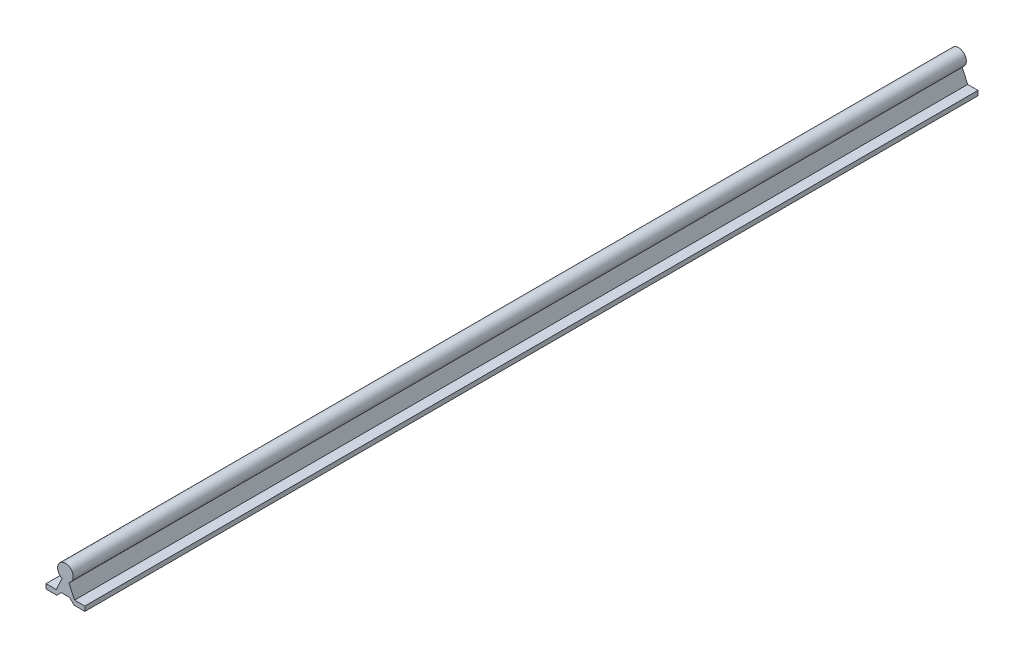
ISO-10303-21;
HEADER;
FILE_DESCRIPTION(('STEP AP214'),'2;1');
FILE_NAME('part.step','',(''),(''),'','','');
FILE_SCHEMA(('AUTOMOTIVE_DESIGN { 1 0 10303 214 1 1 1 1 }'));
ENDSEC;
DATA;
#1=APPLICATION_CONTEXT('core data for automotive mechanical design processes');
#2=APPLICATION_PROTOCOL_DEFINITION('international standard','automotive_design',2000,#1);
#3=PRODUCT_CONTEXT('',#1,'mechanical');
#4=PRODUCT('Part','Part','',(#3));
#5=PRODUCT_RELATED_PRODUCT_CATEGORY('part','',(#4));
#6=PRODUCT_DEFINITION_FORMATION('','',#4);
#7=PRODUCT_DEFINITION_CONTEXT('part definition',#1,'design');
#8=PRODUCT_DEFINITION('design','',#6,#7);
#9=PRODUCT_DEFINITION_SHAPE('','',#8);
#10=(LENGTH_UNIT() NAMED_UNIT(*) SI_UNIT(.MILLI.,.METRE.));
#11=(NAMED_UNIT(*) PLANE_ANGLE_UNIT() SI_UNIT($,.RADIAN.));
#12=(NAMED_UNIT(*) SI_UNIT($,.STERADIAN.) SOLID_ANGLE_UNIT());
#13=UNCERTAINTY_MEASURE_WITH_UNIT(LENGTH_MEASURE(1.E-05),#10,'distance_accuracy_value','');
#14=(GEOMETRIC_REPRESENTATION_CONTEXT(3) GLOBAL_UNCERTAINTY_ASSIGNED_CONTEXT((#13)) GLOBAL_UNIT_ASSIGNED_CONTEXT((#10,
#11,#12)) REPRESENTATION_CONTEXT('',''));
#15=CARTESIAN_POINT('',(0.,0.,0.));
#16=DIRECTION('',(0.,0.,1.));
#17=DIRECTION('',(1.,0.,0.));
#18=AXIS2_PLACEMENT_3D('',#15,#16,#17);
#19=CARTESIAN_POINT('',(9.5641655714519,4.38765921480913,914.4));
#20=DIRECTION('',(0.908917784747808,0.416975371657772,0.));
#21=DIRECTION('',(-0.416975371657772,0.908917784747808,0.));
#22=AXIS2_PLACEMENT_3D('',#19,#20,#21);
#23=PLANE('',#22);
#24=DIRECTION('',(0.416975371657772,-0.908917784747808,0.));
#25=VECTOR('',#24,1.);
#26=CARTESIAN_POINT('',(9.5641655714519,4.38765921480913,0.));
#27=LINE('',#26,#25);
#28=CARTESIAN_POINT('',(3.5,17.6062527150309,0.));
#29=VERTEX_POINT('',#28);
#30=CARTESIAN_POINT('',(9.375,4.79999999999999,0.));
#31=VERTEX_POINT('',#30);
#32=EDGE_CURVE('E155',#29,#31,#27,.T.);
#33=ORIENTED_EDGE('',*,*,#32,.F.);
#34=DIRECTION('',(0.,0.,-1.));
#35=VECTOR('',#34,1.);
#36=CARTESIAN_POINT('',(3.5,17.6062527150309,914.4));
#37=LINE('',#36,#35);
#38=CARTESIAN_POINT('',(3.5,17.6062527150309,914.4));
#39=VERTEX_POINT('',#38);
#40=EDGE_CURVE('E11',#39,#29,#37,.T.);
#41=ORIENTED_EDGE('',*,*,#40,.F.);
#42=DIRECTION('',(0.416975371657772,-0.908917784747808,0.));
#43=VECTOR('',#42,1.);
#44=CARTESIAN_POINT('',(9.5641655714519,4.38765921480913,914.4));
#45=LINE('',#44,#43);
#46=CARTESIAN_POINT('',(9.375,4.79999999999999,914.4));
#47=VERTEX_POINT('',#46);
#48=EDGE_CURVE('E181',#39,#47,#45,.T.);
#49=ORIENTED_EDGE('',*,*,#48,.T.);
#50=DIRECTION('',(0.,0.,-1.));
#51=VECTOR('',#50,1.);
#52=CARTESIAN_POINT('',(9.375,4.79999999999999,914.4));
#53=LINE('',#52,#51);
#54=EDGE_CURVE('E100',#47,#31,#53,.T.);
#55=ORIENTED_EDGE('',*,*,#54,.T.);
#56=EDGE_LOOP('',(#33,#41,#49,#55));
#57=FACE_BOUND('',#56,.T.);
#58=ADVANCED_FACE('F38',(#57),#23,.T.);
#59=CARTESIAN_POINT('',(0.,24.8,914.4));
#60=DIRECTION('',(0.,0.,-1.));
#61=DIRECTION('',(-1.,0.,0.));
#62=AXIS2_PLACEMENT_3D('',#59,#60,#61);
#63=CYLINDRICAL_SURFACE('',#62,8.);
#64=CARTESIAN_POINT('',(0.,24.8,0.));
#65=DIRECTION('',(0.,0.,1.));
#66=DIRECTION('',(1.,0.,0.));
#67=AXIS2_PLACEMENT_3D('',#64,#65,#66);
#68=CIRCLE('',#67,8.);
#69=CARTESIAN_POINT('',(-3.5,17.6062527150309,0.));
#70=VERTEX_POINT('',#69);
#71=EDGE_CURVE('E158',#29,#70,#68,.T.);
#72=ORIENTED_EDGE('',*,*,#71,.T.);
#73=DIRECTION('',(0.,0.,-1.));
#74=VECTOR('',#73,1.);
#75=CARTESIAN_POINT('',(-3.5,17.6062527150309,914.4));
#76=LINE('',#75,#74);
#77=CARTESIAN_POINT('',(-3.5,17.6062527150309,914.4));
#78=VERTEX_POINT('',#77);
#79=EDGE_CURVE('E46',#78,#70,#76,.T.);
#80=ORIENTED_EDGE('',*,*,#79,.F.);
#81=CARTESIAN_POINT('',(0.,24.8,914.4));
#82=DIRECTION('',(0.,0.,1.));
#83=DIRECTION('',(1.,0.,0.));
#84=AXIS2_PLACEMENT_3D('',#81,#82,#83);
#85=CIRCLE('',#84,8.);
#86=EDGE_CURVE('E242',#39,#78,#85,.T.);
#87=ORIENTED_EDGE('',*,*,#86,.F.);
#88=ORIENTED_EDGE('',*,*,#40,.T.);
#89=EDGE_LOOP('',(#72,#80,#87,#88));
#90=FACE_BOUND('',#89,.T.);
#91=ADVANCED_FACE('F245',(#90),#63,.T.);
#92=CARTESIAN_POINT('',(-9.5641655714519,4.38765921480913,914.4));
#93=DIRECTION('',(0.908917784747808,-0.416975371657772,0.));
#94=DIRECTION('',(0.416975371657772,0.908917784747808,0.));
#95=AXIS2_PLACEMENT_3D('',#92,#93,#94);
#96=PLANE('',#95);
#97=DIRECTION('',(-0.416975371657772,-0.908917784747808,0.));
#98=VECTOR('',#97,1.);
#99=CARTESIAN_POINT('',(-9.5641655714519,4.38765921480913,0.));
#100=LINE('',#99,#98);
#101=CARTESIAN_POINT('',(-9.375,4.79999999999999,0.));
#102=VERTEX_POINT('',#101);
#103=EDGE_CURVE('E160',#70,#102,#100,.T.);
#104=ORIENTED_EDGE('',*,*,#103,.T.);
#105=DIRECTION('',(0.,0.,-1.));
#106=VECTOR('',#105,1.);
#107=CARTESIAN_POINT('',(-9.375,4.79999999999999,914.4));
#108=LINE('',#107,#106);
#109=CARTESIAN_POINT('',(-9.375,4.79999999999999,914.4));
#110=VERTEX_POINT('',#109);
#111=EDGE_CURVE('E199',#110,#102,#108,.T.);
#112=ORIENTED_EDGE('',*,*,#111,.F.);
#113=DIRECTION('',(-0.416975371657772,-0.908917784747808,0.));
#114=VECTOR('',#113,1.);
#115=CARTESIAN_POINT('',(-9.5641655714519,4.38765921480913,914.4));
#116=LINE('',#115,#114);
#117=EDGE_CURVE('E208',#78,#110,#116,.T.);
#118=ORIENTED_EDGE('',*,*,#117,.F.);
#119=ORIENTED_EDGE('',*,*,#79,.T.);
#120=EDGE_LOOP('',(#104,#112,#118,#119));
#121=FACE_BOUND('',#120,.T.);
#122=ADVANCED_FACE('F206',(#121),#96,.F.);
#123=CARTESIAN_POINT('',(0.,4.79999999999999,914.4));
#124=DIRECTION('',(0.,-1.,0.));
#125=DIRECTION('',(1.,0.,0.));
#126=AXIS2_PLACEMENT_3D('',#123,#124,#125);
#127=PLANE('',#126);
#128=DIRECTION('',(-1.,0.,0.));
#129=VECTOR('',#128,1.);
#130=CARTESIAN_POINT('',(0.,4.79999999999999,0.));
#131=LINE('',#130,#129);
#132=CARTESIAN_POINT('',(-19.875,4.79999999999999,0.));
#133=VERTEX_POINT('',#132);
#134=EDGE_CURVE('E162',#102,#133,#131,.T.);
#135=ORIENTED_EDGE('',*,*,#134,.T.);
#136=DIRECTION('',(0.,0.,-1.));
#137=VECTOR('',#136,1.);
#138=CARTESIAN_POINT('',(-19.875,4.79999999999999,914.4));
#139=LINE('',#138,#137);
#140=CARTESIAN_POINT('',(-19.875,4.79999999999999,914.4));
#141=VERTEX_POINT('',#140);
#142=EDGE_CURVE('E196',#141,#133,#139,.T.);
#143=ORIENTED_EDGE('',*,*,#142,.F.);
#144=DIRECTION('',(-1.,0.,0.));
#145=VECTOR('',#144,1.);
#146=CARTESIAN_POINT('',(0.,4.79999999999999,914.4));
#147=LINE('',#146,#145);
#148=EDGE_CURVE('E227',#110,#141,#147,.T.);
#149=ORIENTED_EDGE('',*,*,#148,.F.);
#150=ORIENTED_EDGE('',*,*,#111,.T.);
#151=EDGE_LOOP('',(#135,#143,#149,#150));
#152=FACE_BOUND('',#151,.T.);
#153=ADVANCED_FACE('F218',(#152),#127,.F.);
#154=CARTESIAN_POINT('',(-19.875,0.,914.4));
#155=DIRECTION('',(1.,0.,0.));
#156=DIRECTION('',(0.,0.,-1.));
#157=AXIS2_PLACEMENT_3D('',#154,#155,#156);
#158=PLANE('',#157);
#159=DIRECTION('',(0.,-1.,0.));
#160=VECTOR('',#159,1.);
#161=CARTESIAN_POINT('',(-19.875,0.,0.));
#162=LINE('',#161,#160);
#163=CARTESIAN_POINT('',(-19.875,0.,0.));
#164=VERTEX_POINT('',#163);
#165=EDGE_CURVE('E164',#133,#164,#162,.T.);
#166=ORIENTED_EDGE('',*,*,#165,.T.);
#167=DIRECTION('',(0.,0.,-1.));
#168=VECTOR('',#167,1.);
#169=CARTESIAN_POINT('',(-19.875,0.,914.4));
#170=LINE('',#169,#168);
#171=CARTESIAN_POINT('',(-19.875,0.,914.4));
#172=VERTEX_POINT('',#171);
#173=EDGE_CURVE('E193',#172,#164,#170,.T.);
#174=ORIENTED_EDGE('',*,*,#173,.F.);
#175=DIRECTION('',(0.,-1.,0.));
#176=VECTOR('',#175,1.);
#177=CARTESIAN_POINT('',(-19.875,0.,914.4));
#178=LINE('',#177,#176);
#179=EDGE_CURVE('E224',#141,#172,#178,.T.);
#180=ORIENTED_EDGE('',*,*,#179,.F.);
#181=ORIENTED_EDGE('',*,*,#142,.T.);
#182=EDGE_LOOP('',(#166,#174,#180,#181));
#183=FACE_BOUND('',#182,.T.);
#184=ADVANCED_FACE('F222',(#183),#158,.F.);
#185=CARTESIAN_POINT('',(0.,0.,914.4));
#186=DIRECTION('',(0.,1.,0.));
#187=DIRECTION('',(-1.,0.,0.));
#188=AXIS2_PLACEMENT_3D('',#185,#186,#187);
#189=PLANE('',#188);
#190=DIRECTION('',(1.,0.,0.));
#191=VECTOR('',#190,1.);
#192=CARTESIAN_POINT('',(0.,0.,0.));
#193=LINE('',#192,#191);
#194=CARTESIAN_POINT('',(-8.875,0.,0.));
#195=VERTEX_POINT('',#194);
#196=EDGE_CURVE('E166',#164,#195,#193,.T.);
#197=ORIENTED_EDGE('',*,*,#196,.T.);
#198=DIRECTION('',(0.,0.,-1.));
#199=VECTOR('',#198,1.);
#200=CARTESIAN_POINT('',(-8.875,0.,914.4));
#201=LINE('',#200,#199);
#202=CARTESIAN_POINT('',(-8.875,0.,914.4));
#203=VERTEX_POINT('',#202);
#204=EDGE_CURVE('E190',#203,#195,#201,.T.);
#205=ORIENTED_EDGE('',*,*,#204,.F.);
#206=DIRECTION('',(1.,0.,0.));
#207=VECTOR('',#206,1.);
#208=CARTESIAN_POINT('',(0.,0.,914.4));
#209=LINE('',#208,#207);
#210=EDGE_CURVE('E226',#172,#203,#209,.T.);
#211=ORIENTED_EDGE('',*,*,#210,.F.);
#212=ORIENTED_EDGE('',*,*,#173,.T.);
#213=EDGE_LOOP('',(#197,#205,#211,#212));
#214=FACE_BOUND('',#213,.T.);
#215=ADVANCED_FACE('F257',(#214),#189,.F.);
#216=CARTESIAN_POINT('',(-4.43750000000002,4.4375,914.4));
#217=DIRECTION('',(-0.707106781186549,0.707106781186546,0.));
#218=DIRECTION('',(-0.707106781186546,-0.707106781186549,0.));
#219=AXIS2_PLACEMENT_3D('',#216,#217,#218);
#220=PLANE('',#219);
#221=DIRECTION('',(0.707106781186546,0.707106781186549,0.));
#222=VECTOR('',#221,1.);
#223=CARTESIAN_POINT('',(-4.43750000000002,4.4375,0.));
#224=LINE('',#223,#222);
#225=CARTESIAN_POINT('',(-4.27500000000002,4.59999999999999,0.));
#226=VERTEX_POINT('',#225);
#227=EDGE_CURVE('E168',#195,#226,#224,.T.);
#228=ORIENTED_EDGE('',*,*,#227,.T.);
#229=DIRECTION('',(0.,0.,-1.));
#230=VECTOR('',#229,1.);
#231=CARTESIAN_POINT('',(-4.27500000000002,4.59999999999999,914.4));
#232=LINE('',#231,#230);
#233=CARTESIAN_POINT('',(-4.27500000000002,4.59999999999999,914.4));
#234=VERTEX_POINT('',#233);
#235=EDGE_CURVE('E187',#234,#226,#232,.T.);
#236=ORIENTED_EDGE('',*,*,#235,.F.);
#237=DIRECTION('',(0.707106781186546,0.707106781186549,0.));
#238=VECTOR('',#237,1.);
#239=CARTESIAN_POINT('',(-4.43750000000002,4.4375,914.4));
#240=LINE('',#239,#238);
#241=EDGE_CURVE('E229',#203,#234,#240,.T.);
#242=ORIENTED_EDGE('',*,*,#241,.F.);
#243=ORIENTED_EDGE('',*,*,#204,.T.);
#244=EDGE_LOOP('',(#228,#236,#242,#243));
#245=FACE_BOUND('',#244,.T.);
#246=ADVANCED_FACE('F260',(#245),#220,.F.);
#247=CARTESIAN_POINT('',(0.,4.6,914.4));
#248=DIRECTION('',(0.,1.,0.));
#249=DIRECTION('',(-1.,0.,0.));
#250=AXIS2_PLACEMENT_3D('',#247,#248,#249);
#251=PLANE('',#250);
#252=DIRECTION('',(1.,0.,0.));
#253=VECTOR('',#252,1.);
#254=CARTESIAN_POINT('',(0.,4.6,0.));
#255=LINE('',#254,#253);
#256=CARTESIAN_POINT('',(4.27500000000002,4.6,0.));
#257=VERTEX_POINT('',#256);
#258=EDGE_CURVE('E170',#226,#257,#255,.T.);
#259=ORIENTED_EDGE('',*,*,#258,.T.);
#260=DIRECTION('',(0.,0.,-1.));
#261=VECTOR('',#260,1.);
#262=CARTESIAN_POINT('',(4.27500000000002,4.6,914.4));
#263=LINE('',#262,#261);
#264=CARTESIAN_POINT('',(4.27500000000002,4.6,914.4));
#265=VERTEX_POINT('',#264);
#266=EDGE_CURVE('E185',#265,#257,#263,.T.);
#267=ORIENTED_EDGE('',*,*,#266,.F.);
#268=DIRECTION('',(1.,0.,0.));
#269=VECTOR('',#268,1.);
#270=CARTESIAN_POINT('',(0.,4.6,914.4));
#271=LINE('',#270,#269);
#272=EDGE_CURVE('E235',#234,#265,#271,.T.);
#273=ORIENTED_EDGE('',*,*,#272,.F.);
#274=ORIENTED_EDGE('',*,*,#235,.T.);
#275=EDGE_LOOP('',(#259,#267,#273,#274));
#276=FACE_BOUND('',#275,.T.);
#277=ADVANCED_FACE('F264',(#276),#251,.F.);
#278=CARTESIAN_POINT('',(4.43750000000001,4.4375,914.4));
#279=DIRECTION('',(-0.707106781186549,-0.707106781186547,0.));
#280=DIRECTION('',(0.707106781186547,-0.707106781186549,0.));
#281=AXIS2_PLACEMENT_3D('',#278,#279,#280);
#282=PLANE('',#281);
#283=DIRECTION('',(-0.707106781186546,0.707106781186549,0.));
#284=VECTOR('',#283,1.);
#285=CARTESIAN_POINT('',(4.43750000000001,4.4375,0.));
#286=LINE('',#285,#284);
#287=CARTESIAN_POINT('',(8.875,0.,0.));
#288=VERTEX_POINT('',#287);
#289=EDGE_CURVE('E173',#288,#257,#286,.T.);
#290=ORIENTED_EDGE('',*,*,#289,.F.);
#291=DIRECTION('',(0.,0.,-1.));
#292=VECTOR('',#291,1.);
#293=CARTESIAN_POINT('',(8.875,0.,914.4));
#294=LINE('',#293,#292);
#295=CARTESIAN_POINT('',(8.875,0.,914.4));
#296=VERTEX_POINT('',#295);
#297=EDGE_CURVE('E142',#296,#288,#294,.T.);
#298=ORIENTED_EDGE('',*,*,#297,.F.);
#299=DIRECTION('',(-0.707106781186546,0.707106781186549,0.));
#300=VECTOR('',#299,1.);
#301=CARTESIAN_POINT('',(4.43750000000001,4.4375,914.4));
#302=LINE('',#301,#300);
#303=EDGE_CURVE('E148',#296,#265,#302,.T.);
#304=ORIENTED_EDGE('',*,*,#303,.T.);
#305=ORIENTED_EDGE('',*,*,#266,.T.);
#306=EDGE_LOOP('',(#290,#298,#304,#305));
#307=FACE_BOUND('',#306,.T.);
#308=ADVANCED_FACE('F238',(#307),#282,.T.);
#309=CARTESIAN_POINT('',(0.,0.,914.4));
#310=DIRECTION('',(0.,-1.,0.));
#311=DIRECTION('',(1.,0.,0.));
#312=AXIS2_PLACEMENT_3D('',#309,#310,#311);
#313=PLANE('',#312);
#314=DIRECTION('',(-1.,0.,0.));
#315=VECTOR('',#314,1.);
#316=CARTESIAN_POINT('',(0.,0.,0.));
#317=LINE('',#316,#315);
#318=CARTESIAN_POINT('',(19.875,0.,0.));
#319=VERTEX_POINT('',#318);
#320=EDGE_CURVE('E137',#319,#288,#317,.T.);
#321=ORIENTED_EDGE('',*,*,#320,.F.);
#322=DIRECTION('',(0.,0.,-1.));
#323=VECTOR('',#322,1.);
#324=CARTESIAN_POINT('',(19.875,0.,914.4));
#325=LINE('',#324,#323);
#326=CARTESIAN_POINT('',(19.875,0.,914.4));
#327=VERTEX_POINT('',#326);
#328=EDGE_CURVE('E132',#327,#319,#325,.T.);
#329=ORIENTED_EDGE('',*,*,#328,.F.);
#330=DIRECTION('',(-1.,0.,0.));
#331=VECTOR('',#330,1.);
#332=CARTESIAN_POINT('',(0.,0.,914.4));
#333=LINE('',#332,#331);
#334=EDGE_CURVE('E135',#327,#296,#333,.T.);
#335=ORIENTED_EDGE('',*,*,#334,.T.);
#336=ORIENTED_EDGE('',*,*,#297,.T.);
#337=EDGE_LOOP('',(#321,#329,#335,#336));
#338=FACE_BOUND('',#337,.T.);
#339=ADVANCED_FACE('F134',(#338),#313,.T.);
#340=CARTESIAN_POINT('',(19.875,0.,914.4));
#341=DIRECTION('',(1.,0.,0.));
#342=DIRECTION('',(0.,0.,-1.));
#343=AXIS2_PLACEMENT_3D('',#340,#341,#342);
#344=PLANE('',#343);
#345=DIRECTION('',(0.,-1.,0.));
#346=VECTOR('',#345,1.);
#347=CARTESIAN_POINT('',(19.875,0.,0.));
#348=LINE('',#347,#346);
#349=CARTESIAN_POINT('',(19.875,4.79999999999999,0.));
#350=VERTEX_POINT('',#349);
#351=EDGE_CURVE('E177',#350,#319,#348,.T.);
#352=ORIENTED_EDGE('',*,*,#351,.F.);
#353=DIRECTION('',(0.,0.,-1.));
#354=VECTOR('',#353,1.);
#355=CARTESIAN_POINT('',(19.875,4.79999999999999,914.4));
#356=LINE('',#355,#354);
#357=CARTESIAN_POINT('',(19.875,4.79999999999999,914.4));
#358=VERTEX_POINT('',#357);
#359=EDGE_CURVE('E93',#358,#350,#356,.T.);
#360=ORIENTED_EDGE('',*,*,#359,.F.);
#361=DIRECTION('',(0.,-1.,0.));
#362=VECTOR('',#361,1.);
#363=CARTESIAN_POINT('',(19.875,0.,914.4));
#364=LINE('',#363,#362);
#365=EDGE_CURVE('E146',#358,#327,#364,.T.);
#366=ORIENTED_EDGE('',*,*,#365,.T.);
#367=ORIENTED_EDGE('',*,*,#328,.T.);
#368=EDGE_LOOP('',(#352,#360,#366,#367));
#369=FACE_BOUND('',#368,.T.);
#370=ADVANCED_FACE('F150',(#369),#344,.T.);
#371=CARTESIAN_POINT('',(0.,4.79999999999999,914.4));
#372=DIRECTION('',(0.,-1.,0.));
#373=DIRECTION('',(1.,0.,0.));
#374=AXIS2_PLACEMENT_3D('',#371,#372,#373);
#375=PLANE('',#374);
#376=DIRECTION('',(-1.,0.,0.));
#377=VECTOR('',#376,1.);
#378=CARTESIAN_POINT('',(0.,4.79999999999999,0.));
#379=LINE('',#378,#377);
#380=EDGE_CURVE('E179',#350,#31,#379,.T.);
#381=ORIENTED_EDGE('',*,*,#380,.T.);
#382=ORIENTED_EDGE('',*,*,#54,.F.);
#383=DIRECTION('',(-1.,0.,0.));
#384=VECTOR('',#383,1.);
#385=CARTESIAN_POINT('',(0.,4.79999999999999,914.4));
#386=LINE('',#385,#384);
#387=EDGE_CURVE('E54',#358,#47,#386,.T.);
#388=ORIENTED_EDGE('',*,*,#387,.F.);
#389=ORIENTED_EDGE('',*,*,#359,.T.);
#390=EDGE_LOOP('',(#381,#382,#388,#389));
#391=FACE_BOUND('',#390,.T.);
#392=ADVANCED_FACE('F241',(#391),#375,.F.);
#393=CARTESIAN_POINT('',(0.,0.,914.4));
#394=DIRECTION('',(0.,0.,1.));
#395=DIRECTION('',(1.,0.,0.));
#396=AXIS2_PLACEMENT_3D('',#393,#394,#395);
#397=PLANE('',#396);
#398=ORIENTED_EDGE('',*,*,#48,.F.);
#399=ORIENTED_EDGE('',*,*,#86,.T.);
#400=ORIENTED_EDGE('',*,*,#117,.T.);
#401=ORIENTED_EDGE('',*,*,#148,.T.);
#402=ORIENTED_EDGE('',*,*,#179,.T.);
#403=ORIENTED_EDGE('',*,*,#210,.T.);
#404=ORIENTED_EDGE('',*,*,#241,.T.);
#405=ORIENTED_EDGE('',*,*,#272,.T.);
#406=ORIENTED_EDGE('',*,*,#303,.F.);
#407=ORIENTED_EDGE('',*,*,#334,.F.);
#408=ORIENTED_EDGE('',*,*,#365,.F.);
#409=ORIENTED_EDGE('',*,*,#387,.T.);
#410=EDGE_LOOP('',(#398,#399,#400,#401,#402,#403,#404,#405,#406,#407,#408,#409));
#411=FACE_BOUND('',#410,.T.);
#412=ADVANCED_FACE('F145',(#411),#397,.T.);
#413=CARTESIAN_POINT('',(0.,0.,0.));
#414=DIRECTION('',(0.,0.,1.));
#415=DIRECTION('',(1.,0.,0.));
#416=AXIS2_PLACEMENT_3D('',#413,#414,#415);
#417=PLANE('',#416);
#418=ORIENTED_EDGE('',*,*,#32,.T.);
#419=ORIENTED_EDGE('',*,*,#380,.F.);
#420=ORIENTED_EDGE('',*,*,#351,.T.);
#421=ORIENTED_EDGE('',*,*,#320,.T.);
#422=ORIENTED_EDGE('',*,*,#289,.T.);
#423=ORIENTED_EDGE('',*,*,#258,.F.);
#424=ORIENTED_EDGE('',*,*,#227,.F.);
#425=ORIENTED_EDGE('',*,*,#196,.F.);
#426=ORIENTED_EDGE('',*,*,#165,.F.);
#427=ORIENTED_EDGE('',*,*,#134,.F.);
#428=ORIENTED_EDGE('',*,*,#103,.F.);
#429=ORIENTED_EDGE('',*,*,#71,.F.);
#430=EDGE_LOOP('',(#418,#419,#420,#421,#422,#423,#424,#425,#426,#427,#428,#429));
#431=FACE_BOUND('',#430,.T.);
#432=ADVANCED_FACE('F213',(#431),#417,.F.);
#433=CLOSED_SHELL('',(#58,#91,#122,#153,#184,#215,#246,#277,#308,#339,#370,#392,#412,#432));
#434=MANIFOLD_SOLID_BREP('B2',#433);
#435=ADVANCED_BREP_SHAPE_REPRESENTATION('',(#18,#434),#14);
#436=SHAPE_DEFINITION_REPRESENTATION(#9,#435);
ENDSEC;
END-ISO-10303-21;
